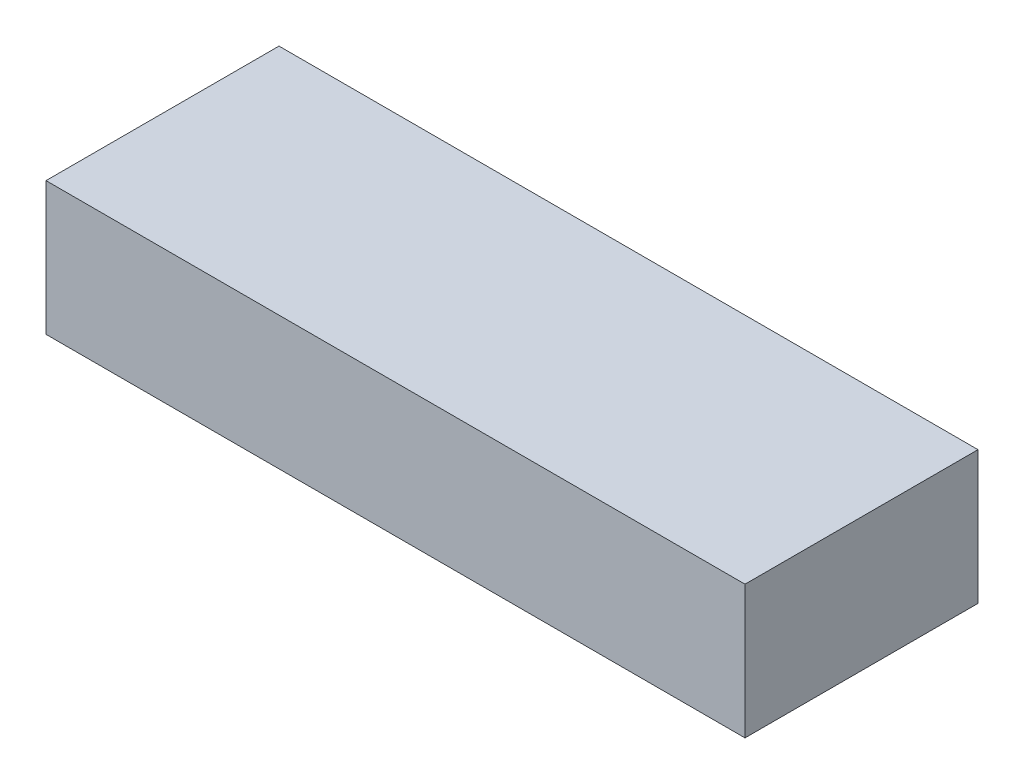
ISO-10303-21;
HEADER;
FILE_DESCRIPTION(('STEP AP214'),'2;1');
FILE_NAME('part.step','',(''),(''),'','','');
FILE_SCHEMA(('AUTOMOTIVE_DESIGN { 1 0 10303 214 1 1 1 1 }'));
ENDSEC;
DATA;
#1=APPLICATION_CONTEXT('core data for automotive mechanical design processes');
#2=APPLICATION_PROTOCOL_DEFINITION('international standard','automotive_design',2000,#1);
#3=PRODUCT_CONTEXT('',#1,'mechanical');
#4=PRODUCT('Part','Part','',(#3));
#5=PRODUCT_RELATED_PRODUCT_CATEGORY('part','',(#4));
#6=PRODUCT_DEFINITION_FORMATION('','',#4);
#7=PRODUCT_DEFINITION_CONTEXT('part definition',#1,'design');
#8=PRODUCT_DEFINITION('design','',#6,#7);
#9=PRODUCT_DEFINITION_SHAPE('','',#8);
#10=(LENGTH_UNIT() NAMED_UNIT(*) SI_UNIT(.MILLI.,.METRE.));
#11=(NAMED_UNIT(*) PLANE_ANGLE_UNIT() SI_UNIT($,.RADIAN.));
#12=(NAMED_UNIT(*) SI_UNIT($,.STERADIAN.) SOLID_ANGLE_UNIT());
#13=UNCERTAINTY_MEASURE_WITH_UNIT(LENGTH_MEASURE(1.E-05),#10,'distance_accuracy_value','');
#14=(GEOMETRIC_REPRESENTATION_CONTEXT(3) GLOBAL_UNCERTAINTY_ASSIGNED_CONTEXT((#13)) GLOBAL_UNIT_ASSIGNED_CONTEXT((#10,
#11,#12)) REPRESENTATION_CONTEXT('',''));
#15=CARTESIAN_POINT('',(0.,0.,0.));
#16=DIRECTION('',(0.,0.,1.));
#17=DIRECTION('',(1.,0.,0.));
#18=AXIS2_PLACEMENT_3D('',#15,#16,#17);
#19=CARTESIAN_POINT('',(-47.1428571428571,20.,-16.5));
#20=DIRECTION('',(1.,0.,0.));
#21=DIRECTION('',(0.,0.,-1.));
#22=AXIS2_PLACEMENT_3D('',#19,#20,#21);
#23=PLANE('',#22);
#24=DIRECTION('',(0.,0.,1.));
#25=VECTOR('',#24,1.);
#26=CARTESIAN_POINT('',(-47.1428571428571,0.,-16.5));
#27=LINE('',#26,#25);
#28=CARTESIAN_POINT('',(-47.1428571428571,0.,-16.5));
#29=VERTEX_POINT('',#28);
#30=CARTESIAN_POINT('',(-47.1428571428571,0.,18.5));
#31=VERTEX_POINT('',#30);
#32=EDGE_CURVE('E95',#29,#31,#27,.T.);
#33=ORIENTED_EDGE('',*,*,#32,.T.);
#34=DIRECTION('',(0.,-1.,0.));
#35=VECTOR('',#34,1.);
#36=CARTESIAN_POINT('',(-47.1428571428571,20.,18.5));
#37=LINE('',#36,#35);
#38=CARTESIAN_POINT('',(-47.1428571428571,20.,18.5));
#39=VERTEX_POINT('',#38);
#40=EDGE_CURVE('E11',#39,#31,#37,.T.);
#41=ORIENTED_EDGE('',*,*,#40,.F.);
#42=DIRECTION('',(0.,0.,1.));
#43=VECTOR('',#42,1.);
#44=CARTESIAN_POINT('',(-47.1428571428571,20.,-16.5));
#45=LINE('',#44,#43);
#46=CARTESIAN_POINT('',(-47.1428571428571,20.,-16.5));
#47=VERTEX_POINT('',#46);
#48=EDGE_CURVE('E83',#47,#39,#45,.T.);
#49=ORIENTED_EDGE('',*,*,#48,.F.);
#50=DIRECTION('',(0.,-1.,0.));
#51=VECTOR('',#50,1.);
#52=CARTESIAN_POINT('',(-47.1428571428571,20.,-16.5));
#53=LINE('',#52,#51);
#54=EDGE_CURVE('E91',#47,#29,#53,.T.);
#55=ORIENTED_EDGE('',*,*,#54,.T.);
#56=EDGE_LOOP('',(#33,#41,#49,#55));
#57=FACE_BOUND('',#56,.T.);
#58=ADVANCED_FACE('F32',(#57),#23,.F.);
#59=CARTESIAN_POINT('',(-47.1428571428571,20.,18.5));
#60=DIRECTION('',(0.,0.,-1.));
#61=DIRECTION('',(-1.,0.,0.));
#62=AXIS2_PLACEMENT_3D('',#59,#60,#61);
#63=PLANE('',#62);
#64=DIRECTION('',(1.,0.,0.));
#65=VECTOR('',#64,1.);
#66=CARTESIAN_POINT('',(-47.1428571428571,0.,18.5));
#67=LINE('',#66,#65);
#68=CARTESIAN_POINT('',(57.8571428571428,0.,18.5));
#69=VERTEX_POINT('',#68);
#70=EDGE_CURVE('E87',#31,#69,#67,.T.);
#71=ORIENTED_EDGE('',*,*,#70,.T.);
#72=DIRECTION('',(0.,-1.,0.));
#73=VECTOR('',#72,1.);
#74=CARTESIAN_POINT('',(57.8571428571428,20.,18.5));
#75=LINE('',#74,#73);
#76=CARTESIAN_POINT('',(57.8571428571428,20.,18.5));
#77=VERTEX_POINT('',#76);
#78=EDGE_CURVE('E40',#77,#69,#75,.T.);
#79=ORIENTED_EDGE('',*,*,#78,.F.);
#80=DIRECTION('',(1.,0.,0.));
#81=VECTOR('',#80,1.);
#82=CARTESIAN_POINT('',(-47.1428571428571,20.,18.5));
#83=LINE('',#82,#81);
#84=EDGE_CURVE('E78',#39,#77,#83,.T.);
#85=ORIENTED_EDGE('',*,*,#84,.F.);
#86=ORIENTED_EDGE('',*,*,#40,.T.);
#87=EDGE_LOOP('',(#71,#79,#85,#86));
#88=FACE_BOUND('',#87,.T.);
#89=ADVANCED_FACE('F86',(#88),#63,.F.);
#90=CARTESIAN_POINT('',(57.8571428571428,20.,-16.5));
#91=DIRECTION('',(-1.,0.,0.));
#92=DIRECTION('',(0.,0.,1.));
#93=AXIS2_PLACEMENT_3D('',#90,#91,#92);
#94=PLANE('',#93);
#95=DIRECTION('',(0.,0.,-1.));
#96=VECTOR('',#95,1.);
#97=CARTESIAN_POINT('',(57.8571428571428,0.,-16.5));
#98=LINE('',#97,#96);
#99=CARTESIAN_POINT('',(57.8571428571428,0.,-16.5));
#100=VERTEX_POINT('',#99);
#101=EDGE_CURVE('E65',#69,#100,#98,.T.);
#102=ORIENTED_EDGE('',*,*,#101,.T.);
#103=DIRECTION('',(0.,-1.,0.));
#104=VECTOR('',#103,1.);
#105=CARTESIAN_POINT('',(57.8571428571428,20.,-16.5));
#106=LINE('',#105,#104);
#107=CARTESIAN_POINT('',(57.8571428571428,20.,-16.5));
#108=VERTEX_POINT('',#107);
#109=EDGE_CURVE('E88',#108,#100,#106,.T.);
#110=ORIENTED_EDGE('',*,*,#109,.F.);
#111=DIRECTION('',(0.,0.,-1.));
#112=VECTOR('',#111,1.);
#113=CARTESIAN_POINT('',(57.8571428571428,20.,-16.5));
#114=LINE('',#113,#112);
#115=EDGE_CURVE('E81',#77,#108,#114,.T.);
#116=ORIENTED_EDGE('',*,*,#115,.F.);
#117=ORIENTED_EDGE('',*,*,#78,.T.);
#118=EDGE_LOOP('',(#102,#110,#116,#117));
#119=FACE_BOUND('',#118,.T.);
#120=ADVANCED_FACE('F89',(#119),#94,.F.);
#121=CARTESIAN_POINT('',(-47.1428571428571,20.,-16.5));
#122=DIRECTION('',(0.,0.,1.));
#123=DIRECTION('',(1.,0.,0.));
#124=AXIS2_PLACEMENT_3D('',#121,#122,#123);
#125=PLANE('',#124);
#126=DIRECTION('',(-1.,0.,0.));
#127=VECTOR('',#126,1.);
#128=CARTESIAN_POINT('',(-47.1428571428571,0.,-16.5));
#129=LINE('',#128,#127);
#130=EDGE_CURVE('E71',#100,#29,#129,.T.);
#131=ORIENTED_EDGE('',*,*,#130,.T.);
#132=ORIENTED_EDGE('',*,*,#54,.F.);
#133=DIRECTION('',(-1.,0.,0.));
#134=VECTOR('',#133,1.);
#135=CARTESIAN_POINT('',(-47.1428571428571,20.,-16.5));
#136=LINE('',#135,#134);
#137=EDGE_CURVE('E48',#108,#47,#136,.T.);
#138=ORIENTED_EDGE('',*,*,#137,.F.);
#139=ORIENTED_EDGE('',*,*,#109,.T.);
#140=EDGE_LOOP('',(#131,#132,#138,#139));
#141=FACE_BOUND('',#140,.T.);
#142=ADVANCED_FACE('F102',(#141),#125,.F.);
#143=CARTESIAN_POINT('',(0.,20.,0.));
#144=DIRECTION('',(0.,1.,0.));
#145=DIRECTION('',(0.,0.,1.));
#146=AXIS2_PLACEMENT_3D('',#143,#144,#145);
#147=PLANE('',#146);
#148=ORIENTED_EDGE('',*,*,#48,.T.);
#149=ORIENTED_EDGE('',*,*,#84,.T.);
#150=ORIENTED_EDGE('',*,*,#115,.T.);
#151=ORIENTED_EDGE('',*,*,#137,.T.);
#152=EDGE_LOOP('',(#148,#149,#150,#151));
#153=FACE_BOUND('',#152,.T.);
#154=ADVANCED_FACE('F79',(#153),#147,.T.);
#155=CARTESIAN_POINT('',(0.,0.,0.));
#156=DIRECTION('',(0.,1.,0.));
#157=DIRECTION('',(0.,0.,1.));
#158=AXIS2_PLACEMENT_3D('',#155,#156,#157);
#159=PLANE('',#158);
#160=ORIENTED_EDGE('',*,*,#32,.F.);
#161=ORIENTED_EDGE('',*,*,#130,.F.);
#162=ORIENTED_EDGE('',*,*,#101,.F.);
#163=ORIENTED_EDGE('',*,*,#70,.F.);
#164=EDGE_LOOP('',(#160,#161,#162,#163));
#165=FACE_BOUND('',#164,.T.);
#166=ADVANCED_FACE('F105',(#165),#159,.F.);
#167=CLOSED_SHELL('',(#58,#89,#120,#142,#154,#166));
#168=MANIFOLD_SOLID_BREP('B2',#167);
#169=ADVANCED_BREP_SHAPE_REPRESENTATION('',(#18,#168),#14);
#170=SHAPE_DEFINITION_REPRESENTATION(#9,#169);
ENDSEC;
END-ISO-10303-21;
